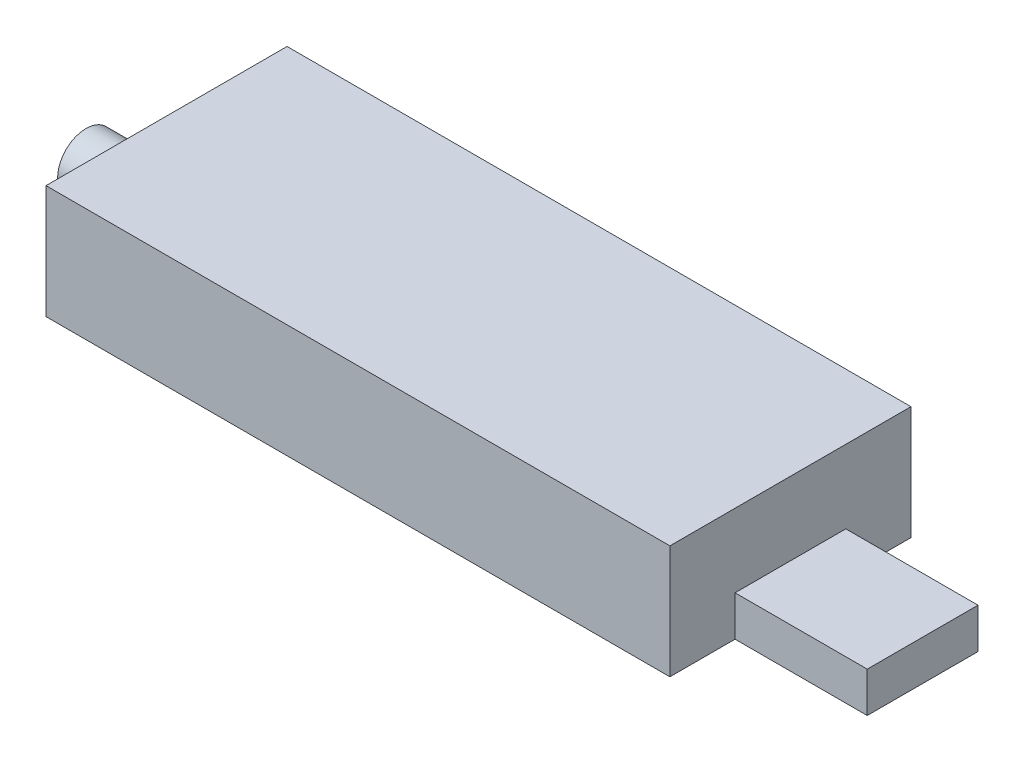
ISO-10303-21;
HEADER;
FILE_DESCRIPTION(('STEP AP214'),'2;1');
FILE_NAME('part.step','',(''),(''),'','','');
FILE_SCHEMA(('AUTOMOTIVE_DESIGN { 1 0 10303 214 1 1 1 1 }'));
ENDSEC;
DATA;
#1=APPLICATION_CONTEXT('core data for automotive mechanical design processes');
#2=APPLICATION_PROTOCOL_DEFINITION('international standard','automotive_design',2000,#1);
#3=PRODUCT_CONTEXT('',#1,'mechanical');
#4=PRODUCT('Part','Part','',(#3));
#5=PRODUCT_RELATED_PRODUCT_CATEGORY('part','',(#4));
#6=PRODUCT_DEFINITION_FORMATION('','',#4);
#7=PRODUCT_DEFINITION_CONTEXT('part definition',#1,'design');
#8=PRODUCT_DEFINITION('design','',#6,#7);
#9=PRODUCT_DEFINITION_SHAPE('','',#8);
#10=(LENGTH_UNIT() NAMED_UNIT(*) SI_UNIT(.MILLI.,.METRE.));
#11=(NAMED_UNIT(*) PLANE_ANGLE_UNIT() SI_UNIT($,.RADIAN.));
#12=(NAMED_UNIT(*) SI_UNIT($,.STERADIAN.) SOLID_ANGLE_UNIT());
#13=UNCERTAINTY_MEASURE_WITH_UNIT(LENGTH_MEASURE(1.E-05),#10,'distance_accuracy_value','');
#14=(GEOMETRIC_REPRESENTATION_CONTEXT(3) GLOBAL_UNCERTAINTY_ASSIGNED_CONTEXT((#13)) GLOBAL_UNIT_ASSIGNED_CONTEXT((#10,
#11,#12)) REPRESENTATION_CONTEXT('',''));
#15=CARTESIAN_POINT('',(0.,0.,0.));
#16=DIRECTION('',(0.,0.,1.));
#17=DIRECTION('',(1.,0.,0.));
#18=AXIS2_PLACEMENT_3D('',#15,#16,#17);
#19=CARTESIAN_POINT('',(69.85,12.7,0.));
#20=DIRECTION('',(-1.,0.,0.));
#21=DIRECTION('',(0.,0.,1.));
#22=AXIS2_PLACEMENT_3D('',#19,#20,#21);
#23=PLANE('',#22);
#24=DIRECTION('',(0.,-1.,0.));
#25=VECTOR('',#24,1.);
#26=CARTESIAN_POINT('',(69.85,0.,-7.29375));
#27=LINE('',#26,#25);
#28=CARTESIAN_POINT('',(69.85,4.5,-7.29375));
#29=VERTEX_POINT('',#28);
#30=CARTESIAN_POINT('',(69.85,0.,-7.29375));
#31=VERTEX_POINT('',#30);
#32=EDGE_CURVE('E55',#29,#31,#27,.T.);
#33=ORIENTED_EDGE('',*,*,#32,.F.);
#34=DIRECTION('',(0.,0.,1.));
#35=VECTOR('',#34,1.);
#36=CARTESIAN_POINT('',(69.85,4.5,-7.29375));
#37=LINE('',#36,#35);
#38=CARTESIAN_POINT('',(69.85,4.5,-19.69375));
#39=VERTEX_POINT('',#38);
#40=EDGE_CURVE('E127',#39,#29,#37,.T.);
#41=ORIENTED_EDGE('',*,*,#40,.F.);
#42=DIRECTION('',(0.,1.,0.));
#43=VECTOR('',#42,1.);
#44=CARTESIAN_POINT('',(69.85,0.,-19.69375));
#45=LINE('',#44,#43);
#46=CARTESIAN_POINT('',(69.85,0.,-19.69375));
#47=VERTEX_POINT('',#46);
#48=EDGE_CURVE('E61',#47,#39,#45,.T.);
#49=ORIENTED_EDGE('',*,*,#48,.F.);
#50=DIRECTION('',(0.,0.,-1.));
#51=VECTOR('',#50,1.);
#52=CARTESIAN_POINT('',(69.85,0.,0.));
#53=LINE('',#52,#51);
#54=CARTESIAN_POINT('',(69.85,0.,-26.9875));
#55=VERTEX_POINT('',#54);
#56=EDGE_CURVE('E159',#47,#55,#53,.T.);
#57=ORIENTED_EDGE('',*,*,#56,.T.);
#58=DIRECTION('',(0.,-1.,0.));
#59=VECTOR('',#58,1.);
#60=CARTESIAN_POINT('',(69.85,12.7,-26.9875));
#61=LINE('',#60,#59);
#62=CARTESIAN_POINT('',(69.85,12.7,-26.9875));
#63=VERTEX_POINT('',#62);
#64=EDGE_CURVE('E168',#63,#55,#61,.T.);
#65=ORIENTED_EDGE('',*,*,#64,.F.);
#66=DIRECTION('',(0.,0.,-1.));
#67=VECTOR('',#66,1.);
#68=CARTESIAN_POINT('',(69.85,12.7,0.));
#69=LINE('',#68,#67);
#70=CARTESIAN_POINT('',(69.85,12.7,0.));
#71=VERTEX_POINT('',#70);
#72=EDGE_CURVE('E150',#71,#63,#69,.T.);
#73=ORIENTED_EDGE('',*,*,#72,.F.);
#74=DIRECTION('',(0.,-1.,0.));
#75=VECTOR('',#74,1.);
#76=CARTESIAN_POINT('',(69.85,12.7,0.));
#77=LINE('',#76,#75);
#78=CARTESIAN_POINT('',(69.85,0.,0.));
#79=VERTEX_POINT('',#78);
#80=EDGE_CURVE('E172',#71,#79,#77,.T.);
#81=ORIENTED_EDGE('',*,*,#80,.T.);
#82=EDGE_CURVE('E160',#79,#31,#53,.T.);
#83=ORIENTED_EDGE('',*,*,#82,.T.);
#84=EDGE_LOOP('',(#33,#41,#49,#57,#65,#73,#81,#83));
#85=FACE_BOUND('',#84,.T.);
#86=ADVANCED_FACE('F39',(#85),#23,.F.);
#87=CARTESIAN_POINT('',(0.,12.7,0.));
#88=DIRECTION('',(1.,0.,0.));
#89=DIRECTION('',(0.,0.,-1.));
#90=AXIS2_PLACEMENT_3D('',#87,#88,#89);
#91=PLANE('',#90);
#92=CARTESIAN_POINT('',(0.,3.81,-13.49375));
#93=DIRECTION('',(1.,0.,0.));
#94=DIRECTION('',(0.,0.,-1.));
#95=AXIS2_PLACEMENT_3D('',#92,#93,#94);
#96=CIRCLE('',#95,3.175);
#97=CARTESIAN_POINT('',(0.,3.81,-16.66875));
#98=VERTEX_POINT('',#97);
#99=EDGE_CURVE('E11',#98,#98,#96,.F.);
#100=ORIENTED_EDGE('',*,*,#99,.F.);
#101=EDGE_LOOP('',(#100));
#102=FACE_BOUND('',#101,.T.);
#103=DIRECTION('',(0.,0.,1.));
#104=VECTOR('',#103,1.);
#105=CARTESIAN_POINT('',(0.,0.,0.));
#106=LINE('',#105,#104);
#107=CARTESIAN_POINT('',(0.,0.,-26.9875));
#108=VERTEX_POINT('',#107);
#109=CARTESIAN_POINT('',(0.,0.,0.));
#110=VERTEX_POINT('',#109);
#111=EDGE_CURVE('E131',#108,#110,#106,.T.);
#112=ORIENTED_EDGE('',*,*,#111,.T.);
#113=DIRECTION('',(0.,-1.,0.));
#114=VECTOR('',#113,1.);
#115=CARTESIAN_POINT('',(0.,12.7,0.));
#116=LINE('',#115,#114);
#117=CARTESIAN_POINT('',(0.,12.7,0.));
#118=VERTEX_POINT('',#117);
#119=EDGE_CURVE('E48',#118,#110,#116,.T.);
#120=ORIENTED_EDGE('',*,*,#119,.F.);
#121=DIRECTION('',(0.,0.,1.));
#122=VECTOR('',#121,1.);
#123=CARTESIAN_POINT('',(0.,12.7,0.));
#124=LINE('',#123,#122);
#125=CARTESIAN_POINT('',(0.,12.7,-26.9875));
#126=VERTEX_POINT('',#125);
#127=EDGE_CURVE('E142',#126,#118,#124,.T.);
#128=ORIENTED_EDGE('',*,*,#127,.F.);
#129=DIRECTION('',(0.,-1.,0.));
#130=VECTOR('',#129,1.);
#131=CARTESIAN_POINT('',(0.,12.7,-26.9875));
#132=LINE('',#131,#130);
#133=EDGE_CURVE('E155',#126,#108,#132,.T.);
#134=ORIENTED_EDGE('',*,*,#133,.T.);
#135=EDGE_LOOP('',(#112,#120,#128,#134));
#136=FACE_BOUND('',#135,.T.);
#137=ADVANCED_FACE('F41',(#102,#136),#91,.F.);
#138=CARTESIAN_POINT('',(0.,12.7,0.));
#139=DIRECTION('',(0.,0.,-1.));
#140=DIRECTION('',(-1.,0.,0.));
#141=AXIS2_PLACEMENT_3D('',#138,#139,#140);
#142=PLANE('',#141);
#143=DIRECTION('',(1.,0.,0.));
#144=VECTOR('',#143,1.);
#145=CARTESIAN_POINT('',(0.,0.,0.));
#146=LINE('',#145,#144);
#147=EDGE_CURVE('E136',#110,#79,#146,.T.);
#148=ORIENTED_EDGE('',*,*,#147,.T.);
#149=ORIENTED_EDGE('',*,*,#80,.F.);
#150=DIRECTION('',(1.,0.,0.));
#151=VECTOR('',#150,1.);
#152=CARTESIAN_POINT('',(0.,12.7,0.));
#153=LINE('',#152,#151);
#154=EDGE_CURVE('E146',#118,#71,#153,.T.);
#155=ORIENTED_EDGE('',*,*,#154,.F.);
#156=ORIENTED_EDGE('',*,*,#119,.T.);
#157=EDGE_LOOP('',(#148,#149,#155,#156));
#158=FACE_BOUND('',#157,.T.);
#159=ADVANCED_FACE('F179',(#158),#142,.F.);
#160=CARTESIAN_POINT('',(0.,12.7,-26.9875));
#161=DIRECTION('',(0.,0.,1.));
#162=DIRECTION('',(1.,0.,0.));
#163=AXIS2_PLACEMENT_3D('',#160,#161,#162);
#164=PLANE('',#163);
#165=DIRECTION('',(-1.,0.,0.));
#166=VECTOR('',#165,1.);
#167=CARTESIAN_POINT('',(0.,0.,-26.9875));
#168=LINE('',#167,#166);
#169=EDGE_CURVE('E147',#55,#108,#168,.T.);
#170=ORIENTED_EDGE('',*,*,#169,.T.);
#171=ORIENTED_EDGE('',*,*,#133,.F.);
#172=DIRECTION('',(-1.,0.,0.));
#173=VECTOR('',#172,1.);
#174=CARTESIAN_POINT('',(0.,12.7,-26.9875));
#175=LINE('',#174,#173);
#176=EDGE_CURVE('E153',#63,#126,#175,.T.);
#177=ORIENTED_EDGE('',*,*,#176,.F.);
#178=ORIENTED_EDGE('',*,*,#64,.T.);
#179=EDGE_LOOP('',(#170,#171,#177,#178));
#180=FACE_BOUND('',#179,.T.);
#181=ADVANCED_FACE('F191',(#180),#164,.F.);
#182=CARTESIAN_POINT('',(0.,12.7,0.));
#183=DIRECTION('',(0.,-1.,0.));
#184=DIRECTION('',(0.,0.,-1.));
#185=AXIS2_PLACEMENT_3D('',#182,#183,#184);
#186=PLANE('',#185);
#187=ORIENTED_EDGE('',*,*,#127,.T.);
#188=ORIENTED_EDGE('',*,*,#154,.T.);
#189=ORIENTED_EDGE('',*,*,#72,.T.);
#190=ORIENTED_EDGE('',*,*,#176,.T.);
#191=EDGE_LOOP('',(#187,#188,#189,#190));
#192=FACE_BOUND('',#191,.T.);
#193=ADVANCED_FACE('F189',(#192),#186,.F.);
#194=CARTESIAN_POINT('',(0.,0.,0.));
#195=DIRECTION('',(0.,-1.,0.));
#196=DIRECTION('',(0.,0.,-1.));
#197=AXIS2_PLACEMENT_3D('',#194,#195,#196);
#198=PLANE('',#197);
#199=ORIENTED_EDGE('',*,*,#111,.F.);
#200=ORIENTED_EDGE('',*,*,#169,.F.);
#201=ORIENTED_EDGE('',*,*,#56,.F.);
#202=DIRECTION('',(-1.,0.,0.));
#203=VECTOR('',#202,1.);
#204=CARTESIAN_POINT('',(84.65,0.,-19.69375));
#205=LINE('',#204,#203);
#206=CARTESIAN_POINT('',(84.65,0.,-19.69375));
#207=VERTEX_POINT('',#206);
#208=EDGE_CURVE('E112',#207,#47,#205,.T.);
#209=ORIENTED_EDGE('',*,*,#208,.F.);
#210=DIRECTION('',(0.,0.,-1.));
#211=VECTOR('',#210,1.);
#212=CARTESIAN_POINT('',(84.65,0.,-7.29375));
#213=LINE('',#212,#211);
#214=CARTESIAN_POINT('',(84.65,0.,-7.29375));
#215=VERTEX_POINT('',#214);
#216=EDGE_CURVE('E104',#215,#207,#213,.T.);
#217=ORIENTED_EDGE('',*,*,#216,.F.);
#218=DIRECTION('',(-1.,0.,0.));
#219=VECTOR('',#218,1.);
#220=CARTESIAN_POINT('',(84.65,0.,-7.29375));
#221=LINE('',#220,#219);
#222=EDGE_CURVE('E110',#215,#31,#221,.T.);
#223=ORIENTED_EDGE('',*,*,#222,.T.);
#224=ORIENTED_EDGE('',*,*,#82,.F.);
#225=ORIENTED_EDGE('',*,*,#147,.F.);
#226=EDGE_LOOP('',(#199,#200,#201,#209,#217,#223,#224,#225));
#227=FACE_BOUND('',#226,.T.);
#228=ADVANCED_FACE('F107',(#227),#198,.T.);
#229=CARTESIAN_POINT('',(84.65,0.,-7.29375));
#230=DIRECTION('',(0.,0.,-1.));
#231=DIRECTION('',(-1.,0.,0.));
#232=AXIS2_PLACEMENT_3D('',#229,#230,#231);
#233=PLANE('',#232);
#234=ORIENTED_EDGE('',*,*,#32,.T.);
#235=ORIENTED_EDGE('',*,*,#222,.F.);
#236=DIRECTION('',(0.,-1.,0.));
#237=VECTOR('',#236,1.);
#238=CARTESIAN_POINT('',(84.65,0.,-7.29375));
#239=LINE('',#238,#237);
#240=CARTESIAN_POINT('',(84.65,4.5,-7.29375));
#241=VERTEX_POINT('',#240);
#242=EDGE_CURVE('E117',#241,#215,#239,.T.);
#243=ORIENTED_EDGE('',*,*,#242,.F.);
#244=DIRECTION('',(-1.,0.,0.));
#245=VECTOR('',#244,1.);
#246=CARTESIAN_POINT('',(84.65,4.5,-7.29375));
#247=LINE('',#246,#245);
#248=EDGE_CURVE('E306',#241,#29,#247,.T.);
#249=ORIENTED_EDGE('',*,*,#248,.T.);
#250=EDGE_LOOP('',(#234,#235,#243,#249));
#251=FACE_BOUND('',#250,.T.);
#252=ADVANCED_FACE('F129',(#251),#233,.F.);
#253=CARTESIAN_POINT('',(84.65,0.,-19.69375));
#254=DIRECTION('',(0.,0.,1.));
#255=DIRECTION('',(0.,-1.,0.));
#256=AXIS2_PLACEMENT_3D('',#253,#254,#255);
#257=PLANE('',#256);
#258=ORIENTED_EDGE('',*,*,#48,.T.);
#259=DIRECTION('',(-1.,0.,0.));
#260=VECTOR('',#259,1.);
#261=CARTESIAN_POINT('',(84.65,4.5,-19.69375));
#262=LINE('',#261,#260);
#263=CARTESIAN_POINT('',(84.65,4.5,-19.69375));
#264=VERTEX_POINT('',#263);
#265=EDGE_CURVE('E138',#264,#39,#262,.T.);
#266=ORIENTED_EDGE('',*,*,#265,.F.);
#267=DIRECTION('',(0.,1.,0.));
#268=VECTOR('',#267,1.);
#269=CARTESIAN_POINT('',(84.65,0.,-19.69375));
#270=LINE('',#269,#268);
#271=EDGE_CURVE('E116',#207,#264,#270,.T.);
#272=ORIENTED_EDGE('',*,*,#271,.F.);
#273=ORIENTED_EDGE('',*,*,#208,.T.);
#274=EDGE_LOOP('',(#258,#266,#272,#273));
#275=FACE_BOUND('',#274,.T.);
#276=ADVANCED_FACE('F227',(#275),#257,.F.);
#277=CARTESIAN_POINT('',(84.65,4.5,-7.29375));
#278=DIRECTION('',(0.,-1.,0.));
#279=DIRECTION('',(0.,0.,-1.));
#280=AXIS2_PLACEMENT_3D('',#277,#278,#279);
#281=PLANE('',#280);
#282=ORIENTED_EDGE('',*,*,#40,.T.);
#283=ORIENTED_EDGE('',*,*,#248,.F.);
#284=DIRECTION('',(0.,0.,1.));
#285=VECTOR('',#284,1.);
#286=CARTESIAN_POINT('',(84.65,4.5,-7.29375));
#287=LINE('',#286,#285);
#288=EDGE_CURVE('E122',#264,#241,#287,.T.);
#289=ORIENTED_EDGE('',*,*,#288,.F.);
#290=ORIENTED_EDGE('',*,*,#265,.T.);
#291=EDGE_LOOP('',(#282,#283,#289,#290));
#292=FACE_BOUND('',#291,.T.);
#293=ADVANCED_FACE('F221',(#292),#281,.F.);
#294=CARTESIAN_POINT('',(84.65,0.,0.));
#295=DIRECTION('',(-1.,0.,0.));
#296=DIRECTION('',(0.,0.,1.));
#297=AXIS2_PLACEMENT_3D('',#294,#295,#296);
#298=PLANE('',#297);
#299=ORIENTED_EDGE('',*,*,#242,.T.);
#300=ORIENTED_EDGE('',*,*,#216,.T.);
#301=ORIENTED_EDGE('',*,*,#271,.T.);
#302=ORIENTED_EDGE('',*,*,#288,.T.);
#303=EDGE_LOOP('',(#299,#300,#301,#302));
#304=FACE_BOUND('',#303,.T.);
#305=ADVANCED_FACE('F120',(#304),#298,.F.);
#306=CARTESIAN_POINT('',(-17.9927561210691,3.81,-13.49375));
#307=DIRECTION('',(1.,0.,0.));
#308=DIRECTION('',(0.,0.,-1.));
#309=AXIS2_PLACEMENT_3D('',#306,#307,#308);
#310=CYLINDRICAL_SURFACE('',#309,3.175);
#311=CARTESIAN_POINT('',(-9.01249999999999,3.81,-13.49375));
#312=DIRECTION('',(1.,0.,0.));
#313=DIRECTION('',(0.,0.,-1.));
#314=AXIS2_PLACEMENT_3D('',#311,#312,#313);
#315=CIRCLE('',#314,3.175);
#316=CARTESIAN_POINT('',(-9.01249999999999,3.81,-16.66875));
#317=VERTEX_POINT('',#316);
#318=EDGE_CURVE('E314',#317,#317,#315,.T.);
#319=ORIENTED_EDGE('',*,*,#318,.T.);
#320=EDGE_LOOP('',(#319));
#321=FACE_BOUND('',#320,.T.);
#322=ORIENTED_EDGE('',*,*,#99,.T.);
#323=EDGE_LOOP('',(#322));
#324=FACE_BOUND('',#323,.T.);
#325=ADVANCED_FACE('F210',(#321,#324),#310,.T.);
#326=CARTESIAN_POINT('',(-9.01249999999999,0.,0.));
#327=DIRECTION('',(1.,0.,0.));
#328=DIRECTION('',(0.,0.,-1.));
#329=AXIS2_PLACEMENT_3D('',#326,#327,#328);
#330=PLANE('',#329);
#331=ORIENTED_EDGE('',*,*,#318,.F.);
#332=EDGE_LOOP('',(#331));
#333=FACE_BOUND('',#332,.T.);
#334=ADVANCED_FACE('F212',(#333),#330,.F.);
#335=CLOSED_SHELL('',(#86,#137,#159,#181,#193,#228,#252,#276,#293,#305,#325,#334));
#336=MANIFOLD_SOLID_BREP('B2',#335);
#337=ADVANCED_BREP_SHAPE_REPRESENTATION('',(#18,#336),#14);
#338=SHAPE_DEFINITION_REPRESENTATION(#9,#337);
ENDSEC;
END-ISO-10303-21;
